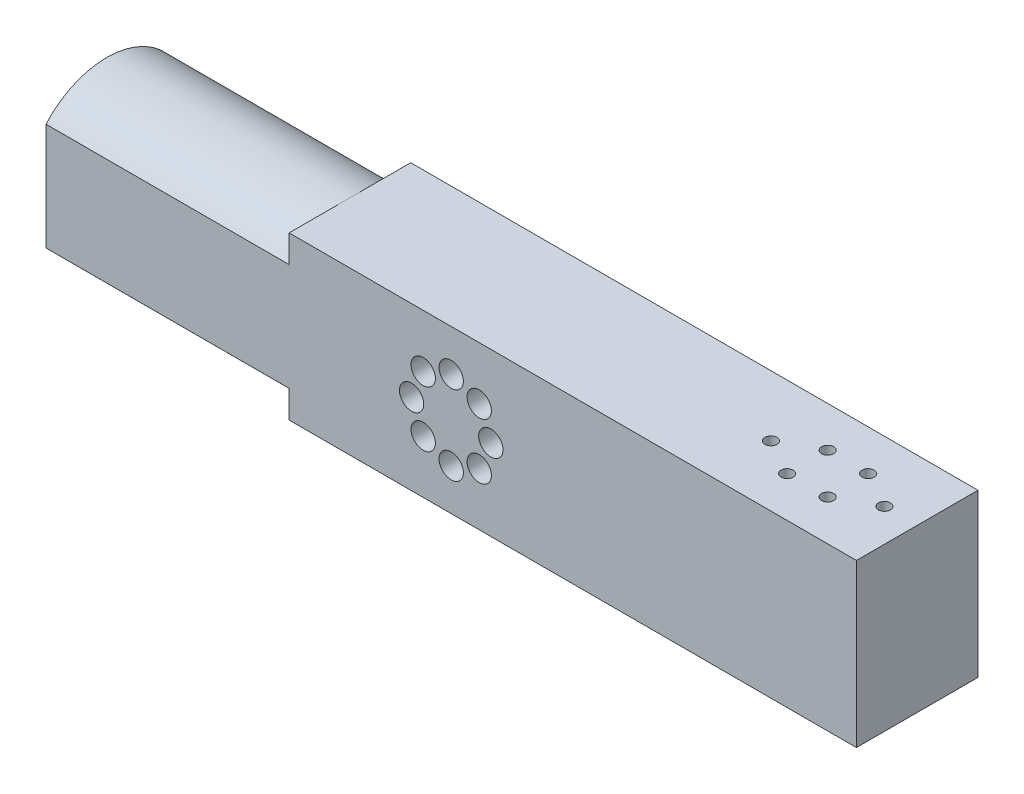
ISO-10303-21;
HEADER;
FILE_DESCRIPTION(('STEP AP214'),'2;1');
FILE_NAME('part.step','',(''),(''),'','','');
FILE_SCHEMA(('AUTOMOTIVE_DESIGN { 1 0 10303 214 1 1 1 1 }'));
ENDSEC;
DATA;
#1=APPLICATION_CONTEXT('core data for automotive mechanical design processes');
#2=APPLICATION_PROTOCOL_DEFINITION('international standard','automotive_design',2000,#1);
#3=PRODUCT_CONTEXT('',#1,'mechanical');
#4=PRODUCT('Part','Part','',(#3));
#5=PRODUCT_RELATED_PRODUCT_CATEGORY('part','',(#4));
#6=PRODUCT_DEFINITION_FORMATION('','',#4);
#7=PRODUCT_DEFINITION_CONTEXT('part definition',#1,'design');
#8=PRODUCT_DEFINITION('design','',#6,#7);
#9=PRODUCT_DEFINITION_SHAPE('','',#8);
#10=(LENGTH_UNIT() NAMED_UNIT(*) SI_UNIT(.MILLI.,.METRE.));
#11=(NAMED_UNIT(*) PLANE_ANGLE_UNIT() SI_UNIT($,.RADIAN.));
#12=(NAMED_UNIT(*) SI_UNIT($,.STERADIAN.) SOLID_ANGLE_UNIT());
#13=UNCERTAINTY_MEASURE_WITH_UNIT(LENGTH_MEASURE(1.E-05),#10,'distance_accuracy_value','');
#14=(GEOMETRIC_REPRESENTATION_CONTEXT(3) GLOBAL_UNCERTAINTY_ASSIGNED_CONTEXT((#13)) GLOBAL_UNIT_ASSIGNED_CONTEXT((#10,
#11,#12)) REPRESENTATION_CONTEXT('',''));
#15=CARTESIAN_POINT('',(0.,0.,0.));
#16=DIRECTION('',(0.,0.,1.));
#17=DIRECTION('',(1.,0.,0.));
#18=AXIS2_PLACEMENT_3D('',#15,#16,#17);
#19=CARTESIAN_POINT('',(-100.,-20.,10.));
#20=DIRECTION('',(1.,0.,0.));
#21=DIRECTION('',(0.,0.,-1.));
#22=AXIS2_PLACEMENT_3D('',#19,#20,#21);
#23=PLANE('',#22);
#24=DIRECTION('',(0.,-1.,0.));
#25=VECTOR('',#24,1.);
#26=CARTESIAN_POINT('',(-100.,0.,30.));
#27=LINE('',#26,#25);
#28=CARTESIAN_POINT('',(-100.,13.228756555323,30.));
#29=VERTEX_POINT('',#28);
#30=CARTESIAN_POINT('',(-100.,-13.228756555323,30.));
#31=VERTEX_POINT('',#30);
#32=EDGE_CURVE('E188',#29,#31,#27,.T.);
#33=ORIENTED_EDGE('',*,*,#32,.F.);
#34=CARTESIAN_POINT('',(-100.,0.,15.));
#35=DIRECTION('',(-1.,0.,0.));
#36=DIRECTION('',(0.,0.,1.));
#37=AXIS2_PLACEMENT_3D('',#34,#35,#36);
#38=CIRCLE('',#37,20.);
#39=CARTESIAN_POINT('',(-100.,13.228756555323,0.));
#40=VERTEX_POINT('',#39);
#41=EDGE_CURVE('E134',#29,#40,#38,.T.);
#42=ORIENTED_EDGE('',*,*,#41,.T.);
#43=DIRECTION('',(0.,-1.,0.));
#44=VECTOR('',#43,1.);
#45=CARTESIAN_POINT('',(-100.,-20.,0.));
#46=LINE('',#45,#44);
#47=CARTESIAN_POINT('',(-100.,-13.228756555323,0.));
#48=VERTEX_POINT('',#47);
#49=EDGE_CURVE('E224',#40,#48,#46,.T.);
#50=ORIENTED_EDGE('',*,*,#49,.T.);
#51=EDGE_CURVE('E137',#48,#31,#38,.T.);
#52=ORIENTED_EDGE('',*,*,#51,.T.);
#53=EDGE_LOOP('',(#33,#42,#50,#52));
#54=FACE_BOUND('',#53,.T.);
#55=ADVANCED_FACE('F36',(#54),#23,.F.);
#56=CARTESIAN_POINT('',(-100.,-20.,10.));
#57=DIRECTION('',(0.,1.,0.));
#58=DIRECTION('',(0.,0.,1.));
#59=AXIS2_PLACEMENT_3D('',#56,#57,#58);
#60=PLANE('',#59);
#61=DIRECTION('',(0.,0.,1.));
#62=VECTOR('',#61,1.);
#63=CARTESIAN_POINT('',(-40.,-20.,0.));
#64=LINE('',#63,#62);
#65=CARTESIAN_POINT('',(-40.,-20.,15.));
#66=VERTEX_POINT('',#65);
#67=CARTESIAN_POINT('',(-40.,-20.,30.));
#68=VERTEX_POINT('',#67);
#69=EDGE_CURVE('E111',#66,#68,#64,.T.);
#70=ORIENTED_EDGE('',*,*,#69,.F.);
#71=DIRECTION('',(0.,0.,1.));
#72=VECTOR('',#71,1.);
#73=CARTESIAN_POINT('',(-40.,-20.,10.));
#74=LINE('',#73,#72);
#75=CARTESIAN_POINT('',(-40.,-20.,0.));
#76=VERTEX_POINT('',#75);
#77=EDGE_CURVE('E11',#76,#66,#74,.T.);
#78=ORIENTED_EDGE('',*,*,#77,.F.);
#79=DIRECTION('',(1.,0.,0.));
#80=VECTOR('',#79,1.);
#81=CARTESIAN_POINT('',(-100.,-20.,0.));
#82=LINE('',#81,#80);
#83=CARTESIAN_POINT('',(100.,-20.,0.));
#84=VERTEX_POINT('',#83);
#85=EDGE_CURVE('E227',#76,#84,#82,.T.);
#86=ORIENTED_EDGE('',*,*,#85,.T.);
#87=DIRECTION('',(0.,0.,-1.));
#88=VECTOR('',#87,1.);
#89=CARTESIAN_POINT('',(100.,-20.,10.));
#90=LINE('',#89,#88);
#91=CARTESIAN_POINT('',(100.,-20.,30.));
#92=VERTEX_POINT('',#91);
#93=EDGE_CURVE('E229',#92,#84,#90,.T.);
#94=ORIENTED_EDGE('',*,*,#93,.F.);
#95=DIRECTION('',(1.,0.,0.));
#96=VECTOR('',#95,1.);
#97=CARTESIAN_POINT('',(0.,-20.,30.));
#98=LINE('',#97,#96);
#99=EDGE_CURVE('E125',#68,#92,#98,.T.);
#100=ORIENTED_EDGE('',*,*,#99,.F.);
#101=EDGE_LOOP('',(#70,#78,#86,#94,#100));
#102=FACE_BOUND('',#101,.T.);
#103=ADVANCED_FACE('F122',(#102),#60,.F.);
#104=CARTESIAN_POINT('',(-100.,20.,10.));
#105=DIRECTION('',(0.,-1.,0.));
#106=DIRECTION('',(0.,0.,-1.));
#107=AXIS2_PLACEMENT_3D('',#104,#105,#106);
#108=PLANE('',#107);
#109=CARTESIAN_POINT('',(91.9,20.,15.));
#110=DIRECTION('',(0.,-1.,0.));
#111=DIRECTION('',(0.,0.,-1.));
#112=AXIS2_PLACEMENT_3D('',#109,#110,#111);
#113=CIRCLE('',#112,1.50000000000001);
#114=CARTESIAN_POINT('',(91.9,20.,13.5));
#115=VERTEX_POINT('',#114);
#116=EDGE_CURVE('E149',#115,#115,#113,.T.);
#117=ORIENTED_EDGE('',*,*,#116,.T.);
#118=EDGE_LOOP('',(#117));
#119=FACE_BOUND('',#118,.T.);
#120=CARTESIAN_POINT('',(82.9,20.,9.99999999999993));
#121=DIRECTION('',(0.,-1.,0.));
#122=DIRECTION('',(0.,0.,-1.));
#123=AXIS2_PLACEMENT_3D('',#120,#121,#122);
#124=CIRCLE('',#123,1.49999999999971);
#125=CARTESIAN_POINT('',(82.9,20.,8.50000000000022));
#126=VERTEX_POINT('',#125);
#127=EDGE_CURVE('E178',#126,#126,#124,.T.);
#128=ORIENTED_EDGE('',*,*,#127,.T.);
#129=EDGE_LOOP('',(#128));
#130=FACE_BOUND('',#129,.T.);
#131=CARTESIAN_POINT('',(82.9,20.,19.9999999999999));
#132=DIRECTION('',(0.,-1.,0.));
#133=DIRECTION('',(0.,0.,-1.));
#134=AXIS2_PLACEMENT_3D('',#131,#132,#133);
#135=CIRCLE('',#134,1.49999999999987);
#136=CARTESIAN_POINT('',(82.9,20.,18.5000000000001));
#137=VERTEX_POINT('',#136);
#138=EDGE_CURVE('E172',#137,#137,#135,.T.);
#139=ORIENTED_EDGE('',*,*,#138,.T.);
#140=EDGE_LOOP('',(#139));
#141=FACE_BOUND('',#140,.T.);
#142=CARTESIAN_POINT('',(72.8999999999999,20.,19.9999999999999));
#143=DIRECTION('',(0.,-1.,0.));
#144=DIRECTION('',(0.,0.,-1.));
#145=AXIS2_PLACEMENT_3D('',#142,#143,#144);
#146=CIRCLE('',#145,1.50000000000001);
#147=CARTESIAN_POINT('',(72.8999999999999,20.,18.4999999999999));
#148=VERTEX_POINT('',#147);
#149=EDGE_CURVE('E166',#148,#148,#146,.T.);
#150=ORIENTED_EDGE('',*,*,#149,.T.);
#151=EDGE_LOOP('',(#150));
#152=FACE_BOUND('',#151,.T.);
#153=CARTESIAN_POINT('',(72.9,20.,9.9999999999999));
#154=DIRECTION('',(0.,-1.,0.));
#155=DIRECTION('',(0.,0.,-1.));
#156=AXIS2_PLACEMENT_3D('',#153,#154,#155);
#157=CIRCLE('',#156,1.49999999999978);
#158=CARTESIAN_POINT('',(72.9,20.,8.50000000000012));
#159=VERTEX_POINT('',#158);
#160=EDGE_CURVE('E160',#159,#159,#157,.T.);
#161=ORIENTED_EDGE('',*,*,#160,.T.);
#162=EDGE_LOOP('',(#161));
#163=FACE_BOUND('',#162,.T.);
#164=CARTESIAN_POINT('',(63.9,20.,14.9999999999999));
#165=DIRECTION('',(0.,-1.,0.));
#166=DIRECTION('',(0.,0.,-1.));
#167=AXIS2_PLACEMENT_3D('',#164,#165,#166);
#168=CIRCLE('',#167,1.50000000000001);
#169=CARTESIAN_POINT('',(63.9,20.,13.4999999999999));
#170=VERTEX_POINT('',#169);
#171=EDGE_CURVE('E154',#170,#170,#168,.T.);
#172=ORIENTED_EDGE('',*,*,#171,.T.);
#173=EDGE_LOOP('',(#172));
#174=FACE_BOUND('',#173,.T.);
#175=DIRECTION('',(0.,0.,1.));
#176=VECTOR('',#175,1.);
#177=CARTESIAN_POINT('',(-40.,20.,0.));
#178=LINE('',#177,#176);
#179=CARTESIAN_POINT('',(-40.,20.,15.));
#180=VERTEX_POINT('',#179);
#181=CARTESIAN_POINT('',(-40.,20.,30.));
#182=VERTEX_POINT('',#181);
#183=EDGE_CURVE('E126',#180,#182,#178,.T.);
#184=ORIENTED_EDGE('',*,*,#183,.T.);
#185=DIRECTION('',(-1.,0.,0.));
#186=VECTOR('',#185,1.);
#187=CARTESIAN_POINT('',(0.,20.,30.));
#188=LINE('',#187,#186);
#189=CARTESIAN_POINT('',(100.,20.,30.));
#190=VERTEX_POINT('',#189);
#191=EDGE_CURVE('E153',#190,#182,#188,.T.);
#192=ORIENTED_EDGE('',*,*,#191,.F.);
#193=DIRECTION('',(0.,0.,-1.));
#194=VECTOR('',#193,1.);
#195=CARTESIAN_POINT('',(100.,20.,10.));
#196=LINE('',#195,#194);
#197=CARTESIAN_POINT('',(100.,20.,0.));
#198=VERTEX_POINT('',#197);
#199=EDGE_CURVE('E44',#190,#198,#196,.T.);
#200=ORIENTED_EDGE('',*,*,#199,.T.);
#201=DIRECTION('',(-1.,0.,0.));
#202=VECTOR('',#201,1.);
#203=CARTESIAN_POINT('',(-100.,20.,0.));
#204=LINE('',#203,#202);
#205=CARTESIAN_POINT('',(-40.,20.,0.));
#206=VERTEX_POINT('',#205);
#207=EDGE_CURVE('E221',#198,#206,#204,.T.);
#208=ORIENTED_EDGE('',*,*,#207,.T.);
#209=DIRECTION('',(0.,0.,1.));
#210=VECTOR('',#209,1.);
#211=CARTESIAN_POINT('',(-40.,20.,0.));
#212=LINE('',#211,#210);
#213=EDGE_CURVE('E136',#206,#180,#212,.T.);
#214=ORIENTED_EDGE('',*,*,#213,.T.);
#215=EDGE_LOOP('',(#184,#192,#200,#208,#214));
#216=FACE_BOUND('',#215,.T.);
#217=ADVANCED_FACE('F236',(#119,#130,#141,#152,#163,#174,#216),#108,.F.);
#218=CARTESIAN_POINT('',(0.,0.,30.));
#219=DIRECTION('',(0.,0.,1.));
#220=DIRECTION('',(1.,0.,0.));
#221=AXIS2_PLACEMENT_3D('',#218,#219,#220);
#222=PLANE('',#221);
#223=CARTESIAN_POINT('',(-6.91479721322183,-6.91479721322384,30.));
#224=DIRECTION('',(0.,0.,1.));
#225=DIRECTION('',(1.,0.,0.));
#226=AXIS2_PLACEMENT_3D('',#223,#224,#225);
#227=CIRCLE('',#226,3.);
#228=CARTESIAN_POINT('',(-3.91479721322183,-6.91479721322384,30.));
#229=VERTEX_POINT('',#228);
#230=EDGE_CURVE('E364',#229,#229,#227,.T.);
#231=ORIENTED_EDGE('',*,*,#230,.F.);
#232=EDGE_LOOP('',(#231));
#233=FACE_BOUND('',#232,.T.);
#234=CARTESIAN_POINT('',(6.91479721322467,-6.91479721322266,30.));
#235=DIRECTION('',(0.,0.,1.));
#236=DIRECTION('',(1.,0.,0.));
#237=AXIS2_PLACEMENT_3D('',#234,#235,#236);
#238=CIRCLE('',#237,3.);
#239=CARTESIAN_POINT('',(9.91479721322467,-6.91479721322266,30.));
#240=VERTEX_POINT('',#239);
#241=EDGE_CURVE('E377',#240,#240,#238,.T.);
#242=ORIENTED_EDGE('',*,*,#241,.F.);
#243=EDGE_LOOP('',(#242));
#244=FACE_BOUND('',#243,.T.);
#245=CARTESIAN_POINT('',(1.66522021490975E-12,-9.779,30.));
#246=DIRECTION('',(0.,0.,1.));
#247=DIRECTION('',(1.,0.,0.));
#248=AXIS2_PLACEMENT_3D('',#245,#246,#247);
#249=CIRCLE('',#248,3.);
#250=CARTESIAN_POINT('',(3.00000000000167,-9.779,30.));
#251=VERTEX_POINT('',#250);
#252=EDGE_CURVE('E365',#251,#251,#249,.T.);
#253=ORIENTED_EDGE('',*,*,#252,.F.);
#254=EDGE_LOOP('',(#253));
#255=FACE_BOUND('',#254,.T.);
#256=CARTESIAN_POINT('',(9.77900000000083,8.32610107454876E-13,30.));
#257=DIRECTION('',(0.,0.,1.));
#258=DIRECTION('',(1.,0.,0.));
#259=AXIS2_PLACEMENT_3D('',#256,#257,#258);
#260=CIRCLE('',#259,3.);
#261=CARTESIAN_POINT('',(12.7790000000008,8.32610107454876E-13,30.));
#262=VERTEX_POINT('',#261);
#263=EDGE_CURVE('E358',#262,#262,#260,.T.);
#264=ORIENTED_EDGE('',*,*,#263,.F.);
#265=EDGE_LOOP('',(#264));
#266=FACE_BOUND('',#265,.T.);
#267=CARTESIAN_POINT('',(6.91479721322349,6.91479721322384,30.));
#268=DIRECTION('',(0.,0.,1.));
#269=DIRECTION('',(1.,0.,0.));
#270=AXIS2_PLACEMENT_3D('',#267,#268,#269);
#271=CIRCLE('',#270,3.);
#272=CARTESIAN_POINT('',(9.91479721322349,6.91479721322384,30.));
#273=VERTEX_POINT('',#272);
#274=EDGE_CURVE('E352',#273,#273,#271,.T.);
#275=ORIENTED_EDGE('',*,*,#274,.F.);
#276=EDGE_LOOP('',(#275));
#277=FACE_BOUND('',#276,.T.);
#278=CARTESIAN_POINT('',(-9.77899999999917,-8.33807689559763E-13,30.));
#279=DIRECTION('',(0.,0.,1.));
#280=DIRECTION('',(1.,0.,0.));
#281=AXIS2_PLACEMENT_3D('',#278,#279,#280);
#282=CIRCLE('',#281,3.);
#283=CARTESIAN_POINT('',(-6.77899999999917,-8.33807689559763E-13,30.));
#284=VERTEX_POINT('',#283);
#285=EDGE_CURVE('E341',#284,#284,#282,.T.);
#286=ORIENTED_EDGE('',*,*,#285,.F.);
#287=EDGE_LOOP('',(#286));
#288=FACE_BOUND('',#287,.T.);
#289=CARTESIAN_POINT('',(-6.91479721322301,6.91479721322266,30.));
#290=DIRECTION('',(0.,0.,1.));
#291=DIRECTION('',(1.,0.,0.));
#292=AXIS2_PLACEMENT_3D('',#289,#290,#291);
#293=CIRCLE('',#292,3.);
#294=CARTESIAN_POINT('',(-3.91479721322301,6.91479721322266,30.));
#295=VERTEX_POINT('',#294);
#296=EDGE_CURVE('E340',#295,#295,#293,.T.);
#297=ORIENTED_EDGE('',*,*,#296,.F.);
#298=EDGE_LOOP('',(#297));
#299=FACE_BOUND('',#298,.T.);
#300=CARTESIAN_POINT('',(0.,9.779,30.));
#301=DIRECTION('',(0.,0.,1.));
#302=DIRECTION('',(1.,0.,0.));
#303=AXIS2_PLACEMENT_3D('',#300,#301,#302);
#304=CIRCLE('',#303,3.);
#305=CARTESIAN_POINT('',(3.,9.779,30.));
#306=VERTEX_POINT('',#305);
#307=EDGE_CURVE('E382',#306,#306,#304,.T.);
#308=ORIENTED_EDGE('',*,*,#307,.F.);
#309=EDGE_LOOP('',(#308));
#310=FACE_BOUND('',#309,.T.);
#311=DIRECTION('',(0.,-1.,0.));
#312=VECTOR('',#311,1.);
#313=CARTESIAN_POINT('',(-40.,0.,30.));
#314=LINE('',#313,#312);
#315=CARTESIAN_POINT('',(-40.,13.228756555323,30.));
#316=VERTEX_POINT('',#315);
#317=EDGE_CURVE('E265',#182,#316,#314,.T.);
#318=ORIENTED_EDGE('',*,*,#317,.T.);
#319=DIRECTION('',(-1.,0.,0.));
#320=VECTOR('',#319,1.);
#321=CARTESIAN_POINT('',(-40.,13.228756555323,30.));
#322=LINE('',#321,#320);
#323=EDGE_CURVE('E250',#316,#29,#322,.T.);
#324=ORIENTED_EDGE('',*,*,#323,.T.);
#325=ORIENTED_EDGE('',*,*,#32,.T.);
#326=DIRECTION('',(-1.,0.,0.));
#327=VECTOR('',#326,1.);
#328=CARTESIAN_POINT('',(-40.,-13.228756555323,30.));
#329=LINE('',#328,#327);
#330=CARTESIAN_POINT('',(-40.,-13.228756555323,30.));
#331=VERTEX_POINT('',#330);
#332=EDGE_CURVE('E262',#31,#331,#329,.F.);
#333=ORIENTED_EDGE('',*,*,#332,.T.);
#334=EDGE_CURVE('E113',#331,#68,#314,.T.);
#335=ORIENTED_EDGE('',*,*,#334,.T.);
#336=ORIENTED_EDGE('',*,*,#99,.T.);
#337=DIRECTION('',(0.,1.,0.));
#338=VECTOR('',#337,1.);
#339=CARTESIAN_POINT('',(100.,0.,30.));
#340=LINE('',#339,#338);
#341=EDGE_CURVE('E192',#92,#190,#340,.T.);
#342=ORIENTED_EDGE('',*,*,#341,.T.);
#343=ORIENTED_EDGE('',*,*,#191,.T.);
#344=EDGE_LOOP('',(#318,#324,#325,#333,#335,#336,#342,#343));
#345=FACE_BOUND('',#344,.T.);
#346=ADVANCED_FACE('F267',(#233,#244,#255,#266,#277,#288,#299,#310,#345),#222,.T.);
#347=CARTESIAN_POINT('',(0.,0.,0.));
#348=DIRECTION('',(0.,0.,-1.));
#349=DIRECTION('',(-1.,0.,0.));
#350=AXIS2_PLACEMENT_3D('',#347,#348,#349);
#351=PLANE('',#350);
#352=CARTESIAN_POINT('',(-9.77899999999917,-8.33807689559763E-13,0.));
#353=DIRECTION('',(0.,0.,1.));
#354=DIRECTION('',(1.,0.,0.));
#355=AXIS2_PLACEMENT_3D('',#352,#353,#354);
#356=CIRCLE('',#355,2.);
#357=CARTESIAN_POINT('',(-7.77899999999917,-8.33807689559763E-13,0.));
#358=VERTEX_POINT('',#357);
#359=EDGE_CURVE('E197',#358,#358,#356,.T.);
#360=ORIENTED_EDGE('',*,*,#359,.T.);
#361=EDGE_LOOP('',(#360));
#362=FACE_BOUND('',#361,.T.);
#363=CARTESIAN_POINT('',(1.66522021490975E-12,-9.779,0.));
#364=DIRECTION('',(0.,0.,1.));
#365=DIRECTION('',(1.,0.,0.));
#366=AXIS2_PLACEMENT_3D('',#363,#364,#365);
#367=CIRCLE('',#366,2.);
#368=CARTESIAN_POINT('',(2.00000000000167,-9.779,0.));
#369=VERTEX_POINT('',#368);
#370=EDGE_CURVE('E203',#369,#369,#367,.T.);
#371=ORIENTED_EDGE('',*,*,#370,.T.);
#372=EDGE_LOOP('',(#371));
#373=FACE_BOUND('',#372,.T.);
#374=CARTESIAN_POINT('',(9.77900000000083,8.32610107454876E-13,0.));
#375=DIRECTION('',(0.,0.,1.));
#376=DIRECTION('',(1.,0.,0.));
#377=AXIS2_PLACEMENT_3D('',#374,#375,#376);
#378=CIRCLE('',#377,2.);
#379=CARTESIAN_POINT('',(11.7790000000008,8.32610107454876E-13,0.));
#380=VERTEX_POINT('',#379);
#381=EDGE_CURVE('E209',#380,#380,#378,.T.);
#382=ORIENTED_EDGE('',*,*,#381,.T.);
#383=EDGE_LOOP('',(#382));
#384=FACE_BOUND('',#383,.T.);
#385=CARTESIAN_POINT('',(0.,9.779,0.));
#386=DIRECTION('',(0.,0.,1.));
#387=DIRECTION('',(1.,0.,0.));
#388=AXIS2_PLACEMENT_3D('',#385,#386,#387);
#389=CIRCLE('',#388,2.);
#390=CARTESIAN_POINT('',(2.,9.779,0.));
#391=VERTEX_POINT('',#390);
#392=EDGE_CURVE('E215',#391,#391,#389,.T.);
#393=ORIENTED_EDGE('',*,*,#392,.T.);
#394=EDGE_LOOP('',(#393));
#395=FACE_BOUND('',#394,.T.);
#396=CARTESIAN_POINT('',(6.91479721322349,6.91479721322384,0.));
#397=DIRECTION('',(0.,0.,1.));
#398=DIRECTION('',(1.,0.,0.));
#399=AXIS2_PLACEMENT_3D('',#396,#397,#398);
#400=CIRCLE('',#399,2.);
#401=CARTESIAN_POINT('',(8.91479721322349,6.91479721322384,0.));
#402=VERTEX_POINT('',#401);
#403=EDGE_CURVE('E212',#402,#402,#400,.T.);
#404=ORIENTED_EDGE('',*,*,#403,.T.);
#405=EDGE_LOOP('',(#404));
#406=FACE_BOUND('',#405,.T.);
#407=CARTESIAN_POINT('',(6.91479721322467,-6.91479721322266,0.));
#408=DIRECTION('',(0.,0.,1.));
#409=DIRECTION('',(1.,0.,0.));
#410=AXIS2_PLACEMENT_3D('',#407,#408,#409);
#411=CIRCLE('',#410,2.);
#412=CARTESIAN_POINT('',(8.91479721322467,-6.91479721322266,0.));
#413=VERTEX_POINT('',#412);
#414=EDGE_CURVE('E206',#413,#413,#411,.T.);
#415=ORIENTED_EDGE('',*,*,#414,.T.);
#416=EDGE_LOOP('',(#415));
#417=FACE_BOUND('',#416,.T.);
#418=CARTESIAN_POINT('',(-6.91479721322183,-6.91479721322384,0.));
#419=DIRECTION('',(0.,0.,1.));
#420=DIRECTION('',(1.,0.,0.));
#421=AXIS2_PLACEMENT_3D('',#418,#419,#420);
#422=CIRCLE('',#421,2.);
#423=CARTESIAN_POINT('',(-4.91479721322183,-6.91479721322384,0.));
#424=VERTEX_POINT('',#423);
#425=EDGE_CURVE('E200',#424,#424,#422,.T.);
#426=ORIENTED_EDGE('',*,*,#425,.T.);
#427=EDGE_LOOP('',(#426));
#428=FACE_BOUND('',#427,.T.);
#429=CARTESIAN_POINT('',(-6.91479721322301,6.91479721322266,0.));
#430=DIRECTION('',(0.,0.,1.));
#431=DIRECTION('',(1.,0.,0.));
#432=AXIS2_PLACEMENT_3D('',#429,#430,#431);
#433=CIRCLE('',#432,2.);
#434=CARTESIAN_POINT('',(-4.91479721322301,6.91479721322266,0.));
#435=VERTEX_POINT('',#434);
#436=EDGE_CURVE('E194',#435,#435,#433,.T.);
#437=ORIENTED_EDGE('',*,*,#436,.T.);
#438=EDGE_LOOP('',(#437));
#439=FACE_BOUND('',#438,.T.);
#440=DIRECTION('',(0.,1.,0.));
#441=VECTOR('',#440,1.);
#442=CARTESIAN_POINT('',(-40.,0.,0.));
#443=LINE('',#442,#441);
#444=CARTESIAN_POINT('',(-40.,-13.228756555323,0.));
#445=VERTEX_POINT('',#444);
#446=EDGE_CURVE('E58',#76,#445,#443,.T.);
#447=ORIENTED_EDGE('',*,*,#446,.T.);
#448=DIRECTION('',(-1.,0.,0.));
#449=VECTOR('',#448,1.);
#450=CARTESIAN_POINT('',(-40.,-13.228756555323,0.));
#451=LINE('',#450,#449);
#452=EDGE_CURVE('E132',#445,#48,#451,.T.);
#453=ORIENTED_EDGE('',*,*,#452,.T.);
#454=ORIENTED_EDGE('',*,*,#49,.F.);
#455=DIRECTION('',(-1.,0.,0.));
#456=VECTOR('',#455,1.);
#457=CARTESIAN_POINT('',(-40.,13.228756555323,0.));
#458=LINE('',#457,#456);
#459=CARTESIAN_POINT('',(-40.,13.228756555323,0.));
#460=VERTEX_POINT('',#459);
#461=EDGE_CURVE('E51',#40,#460,#458,.F.);
#462=ORIENTED_EDGE('',*,*,#461,.T.);
#463=EDGE_CURVE('E143',#460,#206,#443,.T.);
#464=ORIENTED_EDGE('',*,*,#463,.T.);
#465=ORIENTED_EDGE('',*,*,#207,.F.);
#466=DIRECTION('',(0.,1.,0.));
#467=VECTOR('',#466,1.);
#468=CARTESIAN_POINT('',(100.,-20.,0.));
#469=LINE('',#468,#467);
#470=EDGE_CURVE('E218',#84,#198,#469,.T.);
#471=ORIENTED_EDGE('',*,*,#470,.F.);
#472=ORIENTED_EDGE('',*,*,#85,.F.);
#473=EDGE_LOOP('',(#447,#453,#454,#462,#464,#465,#471,#472));
#474=FACE_BOUND('',#473,.T.);
#475=ADVANCED_FACE('F241',(#362,#373,#384,#395,#406,#417,#428,#439,#474),#351,.T.);
#476=CARTESIAN_POINT('',(100.,-20.,10.));
#477=DIRECTION('',(-1.,0.,0.));
#478=DIRECTION('',(0.,0.,1.));
#479=AXIS2_PLACEMENT_3D('',#476,#477,#478);
#480=PLANE('',#479);
#481=ORIENTED_EDGE('',*,*,#470,.T.);
#482=ORIENTED_EDGE('',*,*,#199,.F.);
#483=ORIENTED_EDGE('',*,*,#341,.F.);
#484=ORIENTED_EDGE('',*,*,#93,.T.);
#485=EDGE_LOOP('',(#481,#482,#483,#484));
#486=FACE_BOUND('',#485,.T.);
#487=ADVANCED_FACE('F38',(#486),#480,.F.);
#488=CARTESIAN_POINT('',(0.,9.779,10.));
#489=DIRECTION('',(0.,0.,-1.));
#490=DIRECTION('',(-1.,0.,0.));
#491=AXIS2_PLACEMENT_3D('',#488,#489,#490);
#492=CYLINDRICAL_SURFACE('',#491,2.);
#493=CARTESIAN_POINT('',(0.,9.779,10.));
#494=DIRECTION('',(0.,0.,1.));
#495=DIRECTION('',(1.,0.,0.));
#496=AXIS2_PLACEMENT_3D('',#493,#494,#495);
#497=CIRCLE('',#496,2.);
#498=CARTESIAN_POINT('',(2.,9.779,10.));
#499=VERTEX_POINT('',#498);
#500=EDGE_CURVE('E258',#499,#499,#497,.T.);
#501=ORIENTED_EDGE('',*,*,#500,.T.);
#502=EDGE_LOOP('',(#501));
#503=FACE_BOUND('',#502,.T.);
#504=ORIENTED_EDGE('',*,*,#392,.F.);
#505=EDGE_LOOP('',(#504));
#506=FACE_BOUND('',#505,.T.);
#507=ADVANCED_FACE('F289',(#503,#506),#492,.F.);
#508=CARTESIAN_POINT('',(6.91479721322349,6.91479721322384,10.));
#509=DIRECTION('',(0.,0.,-1.));
#510=DIRECTION('',(-1.,0.,0.));
#511=AXIS2_PLACEMENT_3D('',#508,#509,#510);
#512=CYLINDRICAL_SURFACE('',#511,2.);
#513=CARTESIAN_POINT('',(6.91479721322349,6.91479721322384,10.));
#514=DIRECTION('',(0.,0.,1.));
#515=DIRECTION('',(1.,0.,0.));
#516=AXIS2_PLACEMENT_3D('',#513,#514,#515);
#517=CIRCLE('',#516,2.);
#518=CARTESIAN_POINT('',(8.91479721322349,6.91479721322384,10.));
#519=VERTEX_POINT('',#518);
#520=EDGE_CURVE('E400',#519,#519,#517,.T.);
#521=ORIENTED_EDGE('',*,*,#520,.T.);
#522=EDGE_LOOP('',(#521));
#523=FACE_BOUND('',#522,.T.);
#524=ORIENTED_EDGE('',*,*,#403,.F.);
#525=EDGE_LOOP('',(#524));
#526=FACE_BOUND('',#525,.T.);
#527=ADVANCED_FACE('F292',(#523,#526),#512,.F.);
#528=CARTESIAN_POINT('',(9.77900000000083,8.32610107454876E-13,10.));
#529=DIRECTION('',(0.,0.,-1.));
#530=DIRECTION('',(-1.,0.,0.));
#531=AXIS2_PLACEMENT_3D('',#528,#529,#530);
#532=CYLINDRICAL_SURFACE('',#531,2.);
#533=CARTESIAN_POINT('',(9.77900000000083,8.32610107454876E-13,10.));
#534=DIRECTION('',(0.,0.,1.));
#535=DIRECTION('',(1.,0.,0.));
#536=AXIS2_PLACEMENT_3D('',#533,#534,#535);
#537=CIRCLE('',#536,2.);
#538=CARTESIAN_POINT('',(11.7790000000008,8.32610107454876E-13,10.));
#539=VERTEX_POINT('',#538);
#540=EDGE_CURVE('E398',#539,#539,#537,.T.);
#541=ORIENTED_EDGE('',*,*,#540,.T.);
#542=EDGE_LOOP('',(#541));
#543=FACE_BOUND('',#542,.T.);
#544=ORIENTED_EDGE('',*,*,#381,.F.);
#545=EDGE_LOOP('',(#544));
#546=FACE_BOUND('',#545,.T.);
#547=ADVANCED_FACE('F296',(#543,#546),#532,.F.);
#548=CARTESIAN_POINT('',(6.91479721322467,-6.91479721322266,10.));
#549=DIRECTION('',(0.,0.,-1.));
#550=DIRECTION('',(-1.,0.,0.));
#551=AXIS2_PLACEMENT_3D('',#548,#549,#550);
#552=CYLINDRICAL_SURFACE('',#551,2.);
#553=CARTESIAN_POINT('',(6.91479721322467,-6.91479721322266,10.));
#554=DIRECTION('',(0.,0.,1.));
#555=DIRECTION('',(1.,0.,0.));
#556=AXIS2_PLACEMENT_3D('',#553,#554,#555);
#557=CIRCLE('',#556,2.);
#558=CARTESIAN_POINT('',(8.91479721322467,-6.91479721322266,10.));
#559=VERTEX_POINT('',#558);
#560=EDGE_CURVE('E395',#559,#559,#557,.T.);
#561=ORIENTED_EDGE('',*,*,#560,.T.);
#562=EDGE_LOOP('',(#561));
#563=FACE_BOUND('',#562,.T.);
#564=ORIENTED_EDGE('',*,*,#414,.F.);
#565=EDGE_LOOP('',(#564));
#566=FACE_BOUND('',#565,.T.);
#567=ADVANCED_FACE('F300',(#563,#566),#552,.F.);
#568=CARTESIAN_POINT('',(1.66522021490975E-12,-9.779,10.));
#569=DIRECTION('',(0.,0.,-1.));
#570=DIRECTION('',(-1.,0.,0.));
#571=AXIS2_PLACEMENT_3D('',#568,#569,#570);
#572=CYLINDRICAL_SURFACE('',#571,2.);
#573=CARTESIAN_POINT('',(1.66522021490975E-12,-9.779,10.));
#574=DIRECTION('',(0.,0.,1.));
#575=DIRECTION('',(1.,0.,0.));
#576=AXIS2_PLACEMENT_3D('',#573,#574,#575);
#577=CIRCLE('',#576,2.);
#578=CARTESIAN_POINT('',(2.00000000000167,-9.779,10.));
#579=VERTEX_POINT('',#578);
#580=EDGE_CURVE('E392',#579,#579,#577,.T.);
#581=ORIENTED_EDGE('',*,*,#580,.T.);
#582=EDGE_LOOP('',(#581));
#583=FACE_BOUND('',#582,.T.);
#584=ORIENTED_EDGE('',*,*,#370,.F.);
#585=EDGE_LOOP('',(#584));
#586=FACE_BOUND('',#585,.T.);
#587=ADVANCED_FACE('F304',(#583,#586),#572,.F.);
#588=CARTESIAN_POINT('',(-6.91479721322183,-6.91479721322384,10.));
#589=DIRECTION('',(0.,0.,-1.));
#590=DIRECTION('',(-1.,0.,0.));
#591=AXIS2_PLACEMENT_3D('',#588,#589,#590);
#592=CYLINDRICAL_SURFACE('',#591,2.);
#593=CARTESIAN_POINT('',(-6.91479721322183,-6.91479721322384,10.));
#594=DIRECTION('',(0.,0.,1.));
#595=DIRECTION('',(1.,0.,0.));
#596=AXIS2_PLACEMENT_3D('',#593,#594,#595);
#597=CIRCLE('',#596,2.);
#598=CARTESIAN_POINT('',(-4.91479721322183,-6.91479721322384,10.));
#599=VERTEX_POINT('',#598);
#600=EDGE_CURVE('E389',#599,#599,#597,.T.);
#601=ORIENTED_EDGE('',*,*,#600,.T.);
#602=EDGE_LOOP('',(#601));
#603=FACE_BOUND('',#602,.T.);
#604=ORIENTED_EDGE('',*,*,#425,.F.);
#605=EDGE_LOOP('',(#604));
#606=FACE_BOUND('',#605,.T.);
#607=ADVANCED_FACE('F308',(#603,#606),#592,.F.);
#608=CARTESIAN_POINT('',(-9.77899999999917,-8.33807689559763E-13,10.));
#609=DIRECTION('',(0.,0.,-1.));
#610=DIRECTION('',(-1.,0.,0.));
#611=AXIS2_PLACEMENT_3D('',#608,#609,#610);
#612=CYLINDRICAL_SURFACE('',#611,2.);
#613=CARTESIAN_POINT('',(-9.77899999999917,-8.33807689559763E-13,10.));
#614=DIRECTION('',(0.,0.,1.));
#615=DIRECTION('',(1.,0.,0.));
#616=AXIS2_PLACEMENT_3D('',#613,#614,#615);
#617=CIRCLE('',#616,2.);
#618=CARTESIAN_POINT('',(-7.77899999999917,-8.33807689559763E-13,10.));
#619=VERTEX_POINT('',#618);
#620=EDGE_CURVE('E255',#619,#619,#617,.T.);
#621=ORIENTED_EDGE('',*,*,#620,.T.);
#622=EDGE_LOOP('',(#621));
#623=FACE_BOUND('',#622,.T.);
#624=ORIENTED_EDGE('',*,*,#359,.F.);
#625=EDGE_LOOP('',(#624));
#626=FACE_BOUND('',#625,.T.);
#627=ADVANCED_FACE('F312',(#623,#626),#612,.F.);
#628=CARTESIAN_POINT('',(-6.91479721322301,6.91479721322266,10.));
#629=DIRECTION('',(0.,0.,-1.));
#630=DIRECTION('',(-1.,0.,0.));
#631=AXIS2_PLACEMENT_3D('',#628,#629,#630);
#632=CYLINDRICAL_SURFACE('',#631,2.);
#633=CARTESIAN_POINT('',(-6.91479721322301,6.91479721322266,10.));
#634=DIRECTION('',(0.,0.,1.));
#635=DIRECTION('',(1.,0.,0.));
#636=AXIS2_PLACEMENT_3D('',#633,#634,#635);
#637=CIRCLE('',#636,2.);
#638=CARTESIAN_POINT('',(-4.91479721322301,6.91479721322266,10.));
#639=VERTEX_POINT('',#638);
#640=EDGE_CURVE('E253',#639,#639,#637,.T.);
#641=ORIENTED_EDGE('',*,*,#640,.T.);
#642=EDGE_LOOP('',(#641));
#643=FACE_BOUND('',#642,.T.);
#644=ORIENTED_EDGE('',*,*,#436,.F.);
#645=EDGE_LOOP('',(#644));
#646=FACE_BOUND('',#645,.T.);
#647=ADVANCED_FACE('F315',(#643,#646),#632,.F.);
#648=CARTESIAN_POINT('',(91.9,10.,15.));
#649=DIRECTION('',(0.,1.,0.));
#650=DIRECTION('',(0.,0.,1.));
#651=AXIS2_PLACEMENT_3D('',#648,#649,#650);
#652=CYLINDRICAL_SURFACE('',#651,1.50000000000001);
#653=CARTESIAN_POINT('',(91.9,10.,15.));
#654=DIRECTION('',(0.,-1.,0.));
#655=DIRECTION('',(0.,0.,-1.));
#656=AXIS2_PLACEMENT_3D('',#653,#654,#655);
#657=CIRCLE('',#656,1.50000000000001);
#658=CARTESIAN_POINT('',(91.9,10.,13.5));
#659=VERTEX_POINT('',#658);
#660=EDGE_CURVE('E181',#659,#659,#657,.T.);
#661=ORIENTED_EDGE('',*,*,#660,.T.);
#662=EDGE_LOOP('',(#661));
#663=FACE_BOUND('',#662,.T.);
#664=ORIENTED_EDGE('',*,*,#116,.F.);
#665=EDGE_LOOP('',(#664));
#666=FACE_BOUND('',#665,.T.);
#667=ADVANCED_FACE('F318',(#663,#666),#652,.F.);
#668=CARTESIAN_POINT('',(91.9,10.,15.));
#669=DIRECTION('',(0.,-1.,0.));
#670=DIRECTION('',(0.,0.,-1.));
#671=AXIS2_PLACEMENT_3D('',#668,#669,#670);
#672=PLANE('',#671);
#673=ORIENTED_EDGE('',*,*,#660,.F.);
#674=EDGE_LOOP('',(#673));
#675=FACE_BOUND('',#674,.T.);
#676=ADVANCED_FACE('F323',(#675),#672,.F.);
#677=CARTESIAN_POINT('',(82.9,10.,9.99999999999993));
#678=DIRECTION('',(0.,1.,0.));
#679=DIRECTION('',(0.,0.,1.));
#680=AXIS2_PLACEMENT_3D('',#677,#678,#679);
#681=CYLINDRICAL_SURFACE('',#680,1.49999999999971);
#682=CARTESIAN_POINT('',(82.9,10.,9.99999999999993));
#683=DIRECTION('',(0.,-1.,0.));
#684=DIRECTION('',(0.,0.,-1.));
#685=AXIS2_PLACEMENT_3D('',#682,#683,#684);
#686=CIRCLE('',#685,1.49999999999971);
#687=CARTESIAN_POINT('',(82.9,10.,8.50000000000022));
#688=VERTEX_POINT('',#687);
#689=EDGE_CURVE('E175',#688,#688,#686,.T.);
#690=ORIENTED_EDGE('',*,*,#689,.T.);
#691=EDGE_LOOP('',(#690));
#692=FACE_BOUND('',#691,.T.);
#693=ORIENTED_EDGE('',*,*,#127,.F.);
#694=EDGE_LOOP('',(#693));
#695=FACE_BOUND('',#694,.T.);
#696=ADVANCED_FACE('F463',(#692,#695),#681,.F.);
#697=CARTESIAN_POINT('',(82.9,10.,9.99999999999993));
#698=DIRECTION('',(0.,-1.,0.));
#699=DIRECTION('',(0.,0.,-1.));
#700=AXIS2_PLACEMENT_3D('',#697,#698,#699);
#701=PLANE('',#700);
#702=ORIENTED_EDGE('',*,*,#689,.F.);
#703=EDGE_LOOP('',(#702));
#704=FACE_BOUND('',#703,.T.);
#705=ADVANCED_FACE('F459',(#704),#701,.F.);
#706=CARTESIAN_POINT('',(82.9,10.,19.9999999999999));
#707=DIRECTION('',(0.,1.,0.));
#708=DIRECTION('',(0.,0.,1.));
#709=AXIS2_PLACEMENT_3D('',#706,#707,#708);
#710=CYLINDRICAL_SURFACE('',#709,1.49999999999987);
#711=CARTESIAN_POINT('',(82.9,10.,19.9999999999999));
#712=DIRECTION('',(0.,-1.,0.));
#713=DIRECTION('',(0.,0.,-1.));
#714=AXIS2_PLACEMENT_3D('',#711,#712,#713);
#715=CIRCLE('',#714,1.49999999999987);
#716=CARTESIAN_POINT('',(82.9,10.,18.5000000000001));
#717=VERTEX_POINT('',#716);
#718=EDGE_CURVE('E169',#717,#717,#715,.T.);
#719=ORIENTED_EDGE('',*,*,#718,.T.);
#720=EDGE_LOOP('',(#719));
#721=FACE_BOUND('',#720,.T.);
#722=ORIENTED_EDGE('',*,*,#138,.F.);
#723=EDGE_LOOP('',(#722));
#724=FACE_BOUND('',#723,.T.);
#725=ADVANCED_FACE('F455',(#721,#724),#710,.F.);
#726=CARTESIAN_POINT('',(82.9,10.,19.9999999999999));
#727=DIRECTION('',(0.,-1.,0.));
#728=DIRECTION('',(0.,0.,-1.));
#729=AXIS2_PLACEMENT_3D('',#726,#727,#728);
#730=PLANE('',#729);
#731=ORIENTED_EDGE('',*,*,#718,.F.);
#732=EDGE_LOOP('',(#731));
#733=FACE_BOUND('',#732,.T.);
#734=ADVANCED_FACE('F451',(#733),#730,.F.);
#735=CARTESIAN_POINT('',(72.8999999999999,10.,19.9999999999999));
#736=DIRECTION('',(0.,1.,0.));
#737=DIRECTION('',(0.,0.,1.));
#738=AXIS2_PLACEMENT_3D('',#735,#736,#737);
#739=CYLINDRICAL_SURFACE('',#738,1.50000000000001);
#740=CARTESIAN_POINT('',(72.8999999999999,10.,19.9999999999999));
#741=DIRECTION('',(0.,-1.,0.));
#742=DIRECTION('',(0.,0.,-1.));
#743=AXIS2_PLACEMENT_3D('',#740,#741,#742);
#744=CIRCLE('',#743,1.50000000000001);
#745=CARTESIAN_POINT('',(72.8999999999999,10.,18.4999999999999));
#746=VERTEX_POINT('',#745);
#747=EDGE_CURVE('E163',#746,#746,#744,.T.);
#748=ORIENTED_EDGE('',*,*,#747,.T.);
#749=EDGE_LOOP('',(#748));
#750=FACE_BOUND('',#749,.T.);
#751=ORIENTED_EDGE('',*,*,#149,.F.);
#752=EDGE_LOOP('',(#751));
#753=FACE_BOUND('',#752,.T.);
#754=ADVANCED_FACE('F447',(#750,#753),#739,.F.);
#755=CARTESIAN_POINT('',(72.8999999999999,10.,19.9999999999999));
#756=DIRECTION('',(0.,-1.,0.));
#757=DIRECTION('',(0.,0.,-1.));
#758=AXIS2_PLACEMENT_3D('',#755,#756,#757);
#759=PLANE('',#758);
#760=ORIENTED_EDGE('',*,*,#747,.F.);
#761=EDGE_LOOP('',(#760));
#762=FACE_BOUND('',#761,.T.);
#763=ADVANCED_FACE('F443',(#762),#759,.F.);
#764=CARTESIAN_POINT('',(72.9,10.,9.9999999999999));
#765=DIRECTION('',(0.,1.,0.));
#766=DIRECTION('',(0.,0.,1.));
#767=AXIS2_PLACEMENT_3D('',#764,#765,#766);
#768=CYLINDRICAL_SURFACE('',#767,1.49999999999978);
#769=CARTESIAN_POINT('',(72.9,10.,9.9999999999999));
#770=DIRECTION('',(0.,-1.,0.));
#771=DIRECTION('',(0.,0.,-1.));
#772=AXIS2_PLACEMENT_3D('',#769,#770,#771);
#773=CIRCLE('',#772,1.49999999999978);
#774=CARTESIAN_POINT('',(72.9,10.,8.50000000000012));
#775=VERTEX_POINT('',#774);
#776=EDGE_CURVE('E157',#775,#775,#773,.T.);
#777=ORIENTED_EDGE('',*,*,#776,.T.);
#778=EDGE_LOOP('',(#777));
#779=FACE_BOUND('',#778,.T.);
#780=ORIENTED_EDGE('',*,*,#160,.F.);
#781=EDGE_LOOP('',(#780));
#782=FACE_BOUND('',#781,.T.);
#783=ADVANCED_FACE('F439',(#779,#782),#768,.F.);
#784=CARTESIAN_POINT('',(72.9,10.,9.9999999999999));
#785=DIRECTION('',(0.,-1.,0.));
#786=DIRECTION('',(0.,0.,-1.));
#787=AXIS2_PLACEMENT_3D('',#784,#785,#786);
#788=PLANE('',#787);
#789=ORIENTED_EDGE('',*,*,#776,.F.);
#790=EDGE_LOOP('',(#789));
#791=FACE_BOUND('',#790,.T.);
#792=ADVANCED_FACE('F435',(#791),#788,.F.);
#793=CARTESIAN_POINT('',(63.9,10.,14.9999999999999));
#794=DIRECTION('',(0.,1.,0.));
#795=DIRECTION('',(0.,0.,1.));
#796=AXIS2_PLACEMENT_3D('',#793,#794,#795);
#797=CYLINDRICAL_SURFACE('',#796,1.50000000000001);
#798=CARTESIAN_POINT('',(63.9,10.,14.9999999999999));
#799=DIRECTION('',(0.,-1.,0.));
#800=DIRECTION('',(0.,0.,-1.));
#801=AXIS2_PLACEMENT_3D('',#798,#799,#800);
#802=CIRCLE('',#801,1.50000000000001);
#803=CARTESIAN_POINT('',(63.9,10.,13.4999999999999));
#804=VERTEX_POINT('',#803);
#805=EDGE_CURVE('E150',#804,#804,#802,.T.);
#806=ORIENTED_EDGE('',*,*,#805,.T.);
#807=EDGE_LOOP('',(#806));
#808=FACE_BOUND('',#807,.T.);
#809=ORIENTED_EDGE('',*,*,#171,.F.);
#810=EDGE_LOOP('',(#809));
#811=FACE_BOUND('',#810,.T.);
#812=ADVANCED_FACE('F431',(#808,#811),#797,.F.);
#813=CARTESIAN_POINT('',(63.9,10.,14.9999999999999));
#814=DIRECTION('',(0.,-1.,0.));
#815=DIRECTION('',(0.,0.,-1.));
#816=AXIS2_PLACEMENT_3D('',#813,#814,#815);
#817=PLANE('',#816);
#818=ORIENTED_EDGE('',*,*,#805,.F.);
#819=EDGE_LOOP('',(#818));
#820=FACE_BOUND('',#819,.T.);
#821=ADVANCED_FACE('F428',(#820),#817,.F.);
#822=CARTESIAN_POINT('',(-40.,0.,0.));
#823=DIRECTION('',(-1.,0.,0.));
#824=DIRECTION('',(0.,0.,1.));
#825=AXIS2_PLACEMENT_3D('',#822,#823,#824);
#826=PLANE('',#825);
#827=ORIENTED_EDGE('',*,*,#77,.T.);
#828=CARTESIAN_POINT('',(-40.,0.,15.));
#829=DIRECTION('',(-1.,0.,0.));
#830=DIRECTION('',(0.,0.,1.));
#831=AXIS2_PLACEMENT_3D('',#828,#829,#830);
#832=CIRCLE('',#831,20.);
#833=EDGE_CURVE('E129',#445,#66,#832,.T.);
#834=ORIENTED_EDGE('',*,*,#833,.F.);
#835=ORIENTED_EDGE('',*,*,#446,.F.);
#836=EDGE_LOOP('',(#827,#834,#835));
#837=FACE_BOUND('',#836,.T.);
#838=ADVANCED_FACE('F128',(#837),#826,.T.);
#839=CARTESIAN_POINT('',(-40.,0.,15.));
#840=DIRECTION('',(-1.,0.,0.));
#841=DIRECTION('',(0.,0.,1.));
#842=AXIS2_PLACEMENT_3D('',#839,#840,#841);
#843=CYLINDRICAL_SURFACE('',#842,20.);
#844=ORIENTED_EDGE('',*,*,#833,.T.);
#845=CARTESIAN_POINT('',(-40.,0.,15.));
#846=DIRECTION('',(-1.,0.,0.));
#847=DIRECTION('',(0.,0.,1.));
#848=AXIS2_PLACEMENT_3D('',#845,#846,#847);
#849=CIRCLE('',#848,20.);
#850=EDGE_CURVE('E108',#66,#331,#849,.T.);
#851=ORIENTED_EDGE('',*,*,#850,.T.);
#852=ORIENTED_EDGE('',*,*,#332,.F.);
#853=ORIENTED_EDGE('',*,*,#51,.F.);
#854=ORIENTED_EDGE('',*,*,#452,.F.);
#855=EDGE_LOOP('',(#844,#851,#852,#853,#854));
#856=FACE_BOUND('',#855,.T.);
#857=ADVANCED_FACE('F130',(#856),#843,.T.);
#858=ORIENTED_EDGE('',*,*,#41,.F.);
#859=ORIENTED_EDGE('',*,*,#323,.F.);
#860=EDGE_CURVE('E118',#316,#180,#849,.T.);
#861=ORIENTED_EDGE('',*,*,#860,.T.);
#862=EDGE_CURVE('E133',#180,#460,#832,.T.);
#863=ORIENTED_EDGE('',*,*,#862,.T.);
#864=ORIENTED_EDGE('',*,*,#461,.F.);
#865=EDGE_LOOP('',(#858,#859,#861,#863,#864));
#866=FACE_BOUND('',#865,.T.);
#867=ADVANCED_FACE('F247',(#866),#843,.T.);
#868=ORIENTED_EDGE('',*,*,#862,.F.);
#869=ORIENTED_EDGE('',*,*,#213,.F.);
#870=ORIENTED_EDGE('',*,*,#463,.F.);
#871=EDGE_LOOP('',(#868,#869,#870));
#872=FACE_BOUND('',#871,.T.);
#873=ADVANCED_FACE('F245',(#872),#826,.T.);
#874=CARTESIAN_POINT('',(-40.,0.,0.));
#875=DIRECTION('',(-1.,0.,0.));
#876=DIRECTION('',(0.,0.,1.));
#877=AXIS2_PLACEMENT_3D('',#874,#875,#876);
#878=PLANE('',#877);
#879=ORIENTED_EDGE('',*,*,#183,.F.);
#880=ORIENTED_EDGE('',*,*,#860,.F.);
#881=ORIENTED_EDGE('',*,*,#317,.F.);
#882=EDGE_LOOP('',(#879,#880,#881));
#883=FACE_BOUND('',#882,.T.);
#884=ADVANCED_FACE('F420',(#883),#878,.T.);
#885=ORIENTED_EDGE('',*,*,#850,.F.);
#886=ORIENTED_EDGE('',*,*,#69,.T.);
#887=ORIENTED_EDGE('',*,*,#334,.F.);
#888=EDGE_LOOP('',(#885,#886,#887));
#889=FACE_BOUND('',#888,.T.);
#890=ADVANCED_FACE('F110',(#889),#878,.T.);
#891=CARTESIAN_POINT('',(0.,9.779,30.));
#892=DIRECTION('',(0.,0.,-1.));
#893=DIRECTION('',(-1.,0.,0.));
#894=AXIS2_PLACEMENT_3D('',#891,#892,#893);
#895=CYLINDRICAL_SURFACE('',#894,3.);
#896=ORIENTED_EDGE('',*,*,#307,.T.);
#897=EDGE_LOOP('',(#896));
#898=FACE_BOUND('',#897,.T.);
#899=CARTESIAN_POINT('',(0.,9.779,10.));
#900=DIRECTION('',(0.,0.,1.));
#901=DIRECTION('',(1.,0.,0.));
#902=AXIS2_PLACEMENT_3D('',#899,#900,#901);
#903=CIRCLE('',#902,3.);
#904=CARTESIAN_POINT('',(3.,9.779,10.));
#905=VERTEX_POINT('',#904);
#906=EDGE_CURVE('E344',#905,#905,#903,.T.);
#907=ORIENTED_EDGE('',*,*,#906,.F.);
#908=EDGE_LOOP('',(#907));
#909=FACE_BOUND('',#908,.T.);
#910=ADVANCED_FACE('F410',(#898,#909),#895,.F.);
#911=CARTESIAN_POINT('',(0.,9.779,10.));
#912=DIRECTION('',(0.,0.,1.));
#913=DIRECTION('',(1.,0.,0.));
#914=AXIS2_PLACEMENT_3D('',#911,#912,#913);
#915=PLANE('',#914);
#916=ORIENTED_EDGE('',*,*,#500,.F.);
#917=EDGE_LOOP('',(#916));
#918=FACE_BOUND('',#917,.T.);
#919=ORIENTED_EDGE('',*,*,#906,.T.);
#920=EDGE_LOOP('',(#919));
#921=FACE_BOUND('',#920,.T.);
#922=ADVANCED_FACE('F407',(#918,#921),#915,.T.);
#923=CARTESIAN_POINT('',(-6.91479721322301,6.91479721322266,30.));
#924=DIRECTION('',(0.,0.,-1.));
#925=DIRECTION('',(-1.,0.,0.));
#926=AXIS2_PLACEMENT_3D('',#923,#924,#925);
#927=CYLINDRICAL_SURFACE('',#926,3.);
#928=ORIENTED_EDGE('',*,*,#296,.T.);
#929=EDGE_LOOP('',(#928));
#930=FACE_BOUND('',#929,.T.);
#931=CARTESIAN_POINT('',(-6.91479721322301,6.91479721322266,10.));
#932=DIRECTION('',(0.,0.,1.));
#933=DIRECTION('',(1.,0.,0.));
#934=AXIS2_PLACEMENT_3D('',#931,#932,#933);
#935=CIRCLE('',#934,3.);
#936=CARTESIAN_POINT('',(-3.91479721322301,6.91479721322266,10.));
#937=VERTEX_POINT('',#936);
#938=EDGE_CURVE('E338',#937,#937,#935,.T.);
#939=ORIENTED_EDGE('',*,*,#938,.F.);
#940=EDGE_LOOP('',(#939));
#941=FACE_BOUND('',#940,.T.);
#942=ADVANCED_FACE('F334',(#930,#941),#927,.F.);
#943=CARTESIAN_POINT('',(-6.91479721322301,6.91479721322266,10.));
#944=DIRECTION('',(0.,0.,1.));
#945=DIRECTION('',(1.,0.,0.));
#946=AXIS2_PLACEMENT_3D('',#943,#944,#945);
#947=PLANE('',#946);
#948=ORIENTED_EDGE('',*,*,#640,.F.);
#949=EDGE_LOOP('',(#948));
#950=FACE_BOUND('',#949,.T.);
#951=ORIENTED_EDGE('',*,*,#938,.T.);
#952=EDGE_LOOP('',(#951));
#953=FACE_BOUND('',#952,.T.);
#954=ADVANCED_FACE('F330',(#950,#953),#947,.T.);
#955=CARTESIAN_POINT('',(-9.77899999999917,-8.33807689559763E-13,30.));
#956=DIRECTION('',(0.,0.,-1.));
#957=DIRECTION('',(-1.,0.,0.));
#958=AXIS2_PLACEMENT_3D('',#955,#956,#957);
#959=CYLINDRICAL_SURFACE('',#958,3.);
#960=ORIENTED_EDGE('',*,*,#285,.T.);
#961=EDGE_LOOP('',(#960));
#962=FACE_BOUND('',#961,.T.);
#963=CARTESIAN_POINT('',(-9.77899999999917,-8.33807689559763E-13,10.));
#964=DIRECTION('',(0.,0.,1.));
#965=DIRECTION('',(1.,0.,0.));
#966=AXIS2_PLACEMENT_3D('',#963,#964,#965);
#967=CIRCLE('',#966,3.);
#968=CARTESIAN_POINT('',(-6.77899999999917,-8.33807689559763E-13,10.));
#969=VERTEX_POINT('',#968);
#970=EDGE_CURVE('E347',#969,#969,#967,.T.);
#971=ORIENTED_EDGE('',*,*,#970,.F.);
#972=EDGE_LOOP('',(#971));
#973=FACE_BOUND('',#972,.T.);
#974=ADVANCED_FACE('F333',(#962,#973),#959,.F.);
#975=CARTESIAN_POINT('',(-9.77899999999917,-8.33807689559763E-13,10.));
#976=DIRECTION('',(0.,0.,1.));
#977=DIRECTION('',(1.,0.,0.));
#978=AXIS2_PLACEMENT_3D('',#975,#976,#977);
#979=PLANE('',#978);
#980=ORIENTED_EDGE('',*,*,#620,.F.);
#981=EDGE_LOOP('',(#980));
#982=FACE_BOUND('',#981,.T.);
#983=ORIENTED_EDGE('',*,*,#970,.T.);
#984=EDGE_LOOP('',(#983));
#985=FACE_BOUND('',#984,.T.);
#986=ADVANCED_FACE('F600',(#982,#985),#979,.T.);
#987=CARTESIAN_POINT('',(6.91479721322349,6.91479721322384,30.));
#988=DIRECTION('',(0.,0.,-1.));
#989=DIRECTION('',(-1.,0.,0.));
#990=AXIS2_PLACEMENT_3D('',#987,#988,#989);
#991=CYLINDRICAL_SURFACE('',#990,3.);
#992=ORIENTED_EDGE('',*,*,#274,.T.);
#993=EDGE_LOOP('',(#992));
#994=FACE_BOUND('',#993,.T.);
#995=CARTESIAN_POINT('',(6.91479721322349,6.91479721322384,10.));
#996=DIRECTION('',(0.,0.,1.));
#997=DIRECTION('',(1.,0.,0.));
#998=AXIS2_PLACEMENT_3D('',#995,#996,#997);
#999=CIRCLE('',#998,3.);
#1000=CARTESIAN_POINT('',(9.91479721322349,6.91479721322384,10.));
#1001=VERTEX_POINT('',#1000);
#1002=EDGE_CURVE('E355',#1001,#1001,#999,.T.);
#1003=ORIENTED_EDGE('',*,*,#1002,.F.);
#1004=EDGE_LOOP('',(#1003));
#1005=FACE_BOUND('',#1004,.T.);
#1006=ADVANCED_FACE('F610',(#994,#1005),#991,.F.);
#1007=CARTESIAN_POINT('',(6.91479721322349,6.91479721322384,10.));
#1008=DIRECTION('',(0.,0.,1.));
#1009=DIRECTION('',(1.,0.,0.));
#1010=AXIS2_PLACEMENT_3D('',#1007,#1008,#1009);
#1011=PLANE('',#1010);
#1012=ORIENTED_EDGE('',*,*,#520,.F.);
#1013=EDGE_LOOP('',(#1012));
#1014=FACE_BOUND('',#1013,.T.);
#1015=ORIENTED_EDGE('',*,*,#1002,.T.);
#1016=EDGE_LOOP('',(#1015));
#1017=FACE_BOUND('',#1016,.T.);
#1018=ADVANCED_FACE('F620',(#1014,#1017),#1011,.T.);
#1019=CARTESIAN_POINT('',(9.77900000000083,8.32610107454876E-13,30.));
#1020=DIRECTION('',(0.,0.,-1.));
#1021=DIRECTION('',(-1.,0.,0.));
#1022=AXIS2_PLACEMENT_3D('',#1019,#1020,#1021);
#1023=CYLINDRICAL_SURFACE('',#1022,3.);
#1024=ORIENTED_EDGE('',*,*,#263,.T.);
#1025=EDGE_LOOP('',(#1024));
#1026=FACE_BOUND('',#1025,.T.);
#1027=CARTESIAN_POINT('',(9.77900000000083,8.32610107454876E-13,10.));
#1028=DIRECTION('',(0.,0.,1.));
#1029=DIRECTION('',(1.,0.,0.));
#1030=AXIS2_PLACEMENT_3D('',#1027,#1028,#1029);
#1031=CIRCLE('',#1030,3.);
#1032=CARTESIAN_POINT('',(12.7790000000008,8.32610107454876E-13,10.));
#1033=VERTEX_POINT('',#1032);
#1034=EDGE_CURVE('E361',#1033,#1033,#1031,.T.);
#1035=ORIENTED_EDGE('',*,*,#1034,.F.);
#1036=EDGE_LOOP('',(#1035));
#1037=FACE_BOUND('',#1036,.T.);
#1038=ADVANCED_FACE('F630',(#1026,#1037),#1023,.F.);
#1039=CARTESIAN_POINT('',(9.77900000000083,8.32610107454876E-13,10.));
#1040=DIRECTION('',(0.,0.,1.));
#1041=DIRECTION('',(1.,0.,0.));
#1042=AXIS2_PLACEMENT_3D('',#1039,#1040,#1041);
#1043=PLANE('',#1042);
#1044=ORIENTED_EDGE('',*,*,#540,.F.);
#1045=EDGE_LOOP('',(#1044));
#1046=FACE_BOUND('',#1045,.T.);
#1047=ORIENTED_EDGE('',*,*,#1034,.T.);
#1048=EDGE_LOOP('',(#1047));
#1049=FACE_BOUND('',#1048,.T.);
#1050=ADVANCED_FACE('F640',(#1046,#1049),#1043,.T.);
#1051=CARTESIAN_POINT('',(1.66522021490975E-12,-9.779,30.));
#1052=DIRECTION('',(0.,0.,-1.));
#1053=DIRECTION('',(-1.,0.,0.));
#1054=AXIS2_PLACEMENT_3D('',#1051,#1052,#1053);
#1055=CYLINDRICAL_SURFACE('',#1054,3.);
#1056=ORIENTED_EDGE('',*,*,#252,.T.);
#1057=EDGE_LOOP('',(#1056));
#1058=FACE_BOUND('',#1057,.T.);
#1059=CARTESIAN_POINT('',(1.66522021490975E-12,-9.779,10.));
#1060=DIRECTION('',(0.,0.,1.));
#1061=DIRECTION('',(1.,0.,0.));
#1062=AXIS2_PLACEMENT_3D('',#1059,#1060,#1061);
#1063=CIRCLE('',#1062,3.);
#1064=CARTESIAN_POINT('',(3.00000000000167,-9.779,10.));
#1065=VERTEX_POINT('',#1064);
#1066=EDGE_CURVE('E369',#1065,#1065,#1063,.T.);
#1067=ORIENTED_EDGE('',*,*,#1066,.F.);
#1068=EDGE_LOOP('',(#1067));
#1069=FACE_BOUND('',#1068,.T.);
#1070=ADVANCED_FACE('F650',(#1058,#1069),#1055,.F.);
#1071=CARTESIAN_POINT('',(1.66522021490975E-12,-9.779,10.));
#1072=DIRECTION('',(0.,0.,1.));
#1073=DIRECTION('',(1.,0.,0.));
#1074=AXIS2_PLACEMENT_3D('',#1071,#1072,#1073);
#1075=PLANE('',#1074);
#1076=ORIENTED_EDGE('',*,*,#580,.F.);
#1077=EDGE_LOOP('',(#1076));
#1078=FACE_BOUND('',#1077,.T.);
#1079=ORIENTED_EDGE('',*,*,#1066,.T.);
#1080=EDGE_LOOP('',(#1079));
#1081=FACE_BOUND('',#1080,.T.);
#1082=ADVANCED_FACE('F660',(#1078,#1081),#1075,.T.);
#1083=CARTESIAN_POINT('',(6.91479721322467,-6.91479721322266,30.));
#1084=DIRECTION('',(0.,0.,-1.));
#1085=DIRECTION('',(-1.,0.,0.));
#1086=AXIS2_PLACEMENT_3D('',#1083,#1084,#1085);
#1087=CYLINDRICAL_SURFACE('',#1086,3.);
#1088=ORIENTED_EDGE('',*,*,#241,.T.);
#1089=EDGE_LOOP('',(#1088));
#1090=FACE_BOUND('',#1089,.T.);
#1091=CARTESIAN_POINT('',(6.91479721322467,-6.91479721322266,10.));
#1092=DIRECTION('',(0.,0.,1.));
#1093=DIRECTION('',(1.,0.,0.));
#1094=AXIS2_PLACEMENT_3D('',#1091,#1092,#1093);
#1095=CIRCLE('',#1094,3.);
#1096=CARTESIAN_POINT('',(9.91479721322467,-6.91479721322266,10.));
#1097=VERTEX_POINT('',#1096);
#1098=EDGE_CURVE('E368',#1097,#1097,#1095,.T.);
#1099=ORIENTED_EDGE('',*,*,#1098,.F.);
#1100=EDGE_LOOP('',(#1099));
#1101=FACE_BOUND('',#1100,.T.);
#1102=ADVANCED_FACE('F670',(#1090,#1101),#1087,.F.);
#1103=CARTESIAN_POINT('',(6.91479721322467,-6.91479721322266,10.));
#1104=DIRECTION('',(0.,0.,1.));
#1105=DIRECTION('',(1.,0.,0.));
#1106=AXIS2_PLACEMENT_3D('',#1103,#1104,#1105);
#1107=PLANE('',#1106);
#1108=ORIENTED_EDGE('',*,*,#560,.F.);
#1109=EDGE_LOOP('',(#1108));
#1110=FACE_BOUND('',#1109,.T.);
#1111=ORIENTED_EDGE('',*,*,#1098,.T.);
#1112=EDGE_LOOP('',(#1111));
#1113=FACE_BOUND('',#1112,.T.);
#1114=ADVANCED_FACE('F680',(#1110,#1113),#1107,.T.);
#1115=CARTESIAN_POINT('',(-6.91479721322183,-6.91479721322384,30.));
#1116=DIRECTION('',(0.,0.,-1.));
#1117=DIRECTION('',(-1.,0.,0.));
#1118=AXIS2_PLACEMENT_3D('',#1115,#1116,#1117);
#1119=CYLINDRICAL_SURFACE('',#1118,3.);
#1120=ORIENTED_EDGE('',*,*,#230,.T.);
#1121=EDGE_LOOP('',(#1120));
#1122=FACE_BOUND('',#1121,.T.);
#1123=CARTESIAN_POINT('',(-6.91479721322183,-6.91479721322384,10.));
#1124=DIRECTION('',(0.,0.,1.));
#1125=DIRECTION('',(1.,0.,0.));
#1126=AXIS2_PLACEMENT_3D('',#1123,#1124,#1125);
#1127=CIRCLE('',#1126,3.);
#1128=CARTESIAN_POINT('',(-3.91479721322183,-6.91479721322384,10.));
#1129=VERTEX_POINT('',#1128);
#1130=EDGE_CURVE('E374',#1129,#1129,#1127,.T.);
#1131=ORIENTED_EDGE('',*,*,#1130,.F.);
#1132=EDGE_LOOP('',(#1131));
#1133=FACE_BOUND('',#1132,.T.);
#1134=ADVANCED_FACE('F689',(#1122,#1133),#1119,.F.);
#1135=CARTESIAN_POINT('',(-6.91479721322183,-6.91479721322384,10.));
#1136=DIRECTION('',(0.,0.,1.));
#1137=DIRECTION('',(1.,0.,0.));
#1138=AXIS2_PLACEMENT_3D('',#1135,#1136,#1137);
#1139=PLANE('',#1138);
#1140=ORIENTED_EDGE('',*,*,#600,.F.);
#1141=EDGE_LOOP('',(#1140));
#1142=FACE_BOUND('',#1141,.T.);
#1143=ORIENTED_EDGE('',*,*,#1130,.T.);
#1144=EDGE_LOOP('',(#1143));
#1145=FACE_BOUND('',#1144,.T.);
#1146=ADVANCED_FACE('F699',(#1142,#1145),#1139,.T.);
#1147=CLOSED_SHELL('',(#55,#103,#217,#346,#475,#487,#507,#527,#547,#567,#587,#607,#627,#647,
#667,#676,#696,#705,#725,#734,#754,#763,#783,#792,#812,#821,#838,#857,#867,#873,#884,#890,#910,
#922,#942,#954,#974,#986,#1006,#1018,#1038,#1050,#1070,#1082,#1102,#1114,#1134,#1146));
#1148=MANIFOLD_SOLID_BREP('B2',#1147);
#1149=ADVANCED_BREP_SHAPE_REPRESENTATION('',(#18,#1148),#14);
#1150=SHAPE_DEFINITION_REPRESENTATION(#9,#1149);
ENDSEC;
END-ISO-10303-21;
